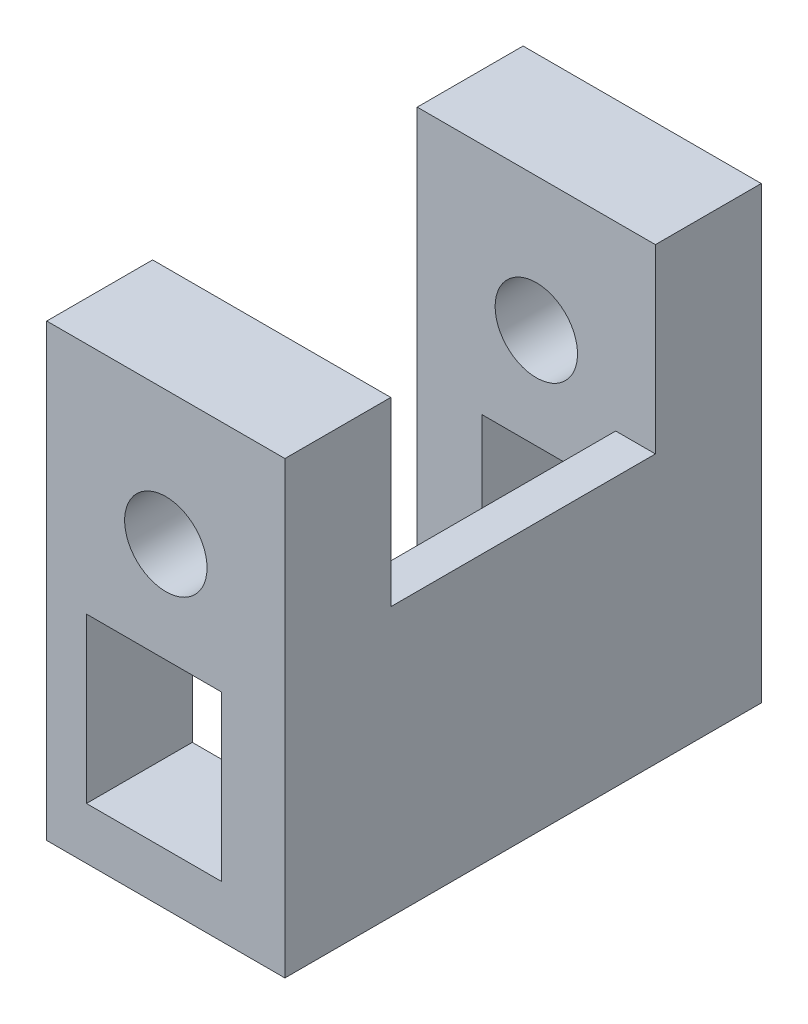
ISO-10303-21;
HEADER;
FILE_DESCRIPTION(('STEP AP214'),'2;1');
FILE_NAME('part.step','',(''),(''),'','','');
FILE_SCHEMA(('AUTOMOTIVE_DESIGN { 1 0 10303 214 1 1 1 1 }'));
ENDSEC;
DATA;
#1=APPLICATION_CONTEXT('core data for automotive mechanical design processes');
#2=APPLICATION_PROTOCOL_DEFINITION('international standard','automotive_design',2000,#1);
#3=PRODUCT_CONTEXT('',#1,'mechanical');
#4=PRODUCT('Part','Part','',(#3));
#5=PRODUCT_RELATED_PRODUCT_CATEGORY('part','',(#4));
#6=PRODUCT_DEFINITION_FORMATION('','',#4);
#7=PRODUCT_DEFINITION_CONTEXT('part definition',#1,'design');
#8=PRODUCT_DEFINITION('design','',#6,#7);
#9=PRODUCT_DEFINITION_SHAPE('','',#8);
#10=(LENGTH_UNIT() NAMED_UNIT(*) SI_UNIT(.MILLI.,.METRE.));
#11=(NAMED_UNIT(*) PLANE_ANGLE_UNIT() SI_UNIT($,.RADIAN.));
#12=(NAMED_UNIT(*) SI_UNIT($,.STERADIAN.) SOLID_ANGLE_UNIT());
#13=UNCERTAINTY_MEASURE_WITH_UNIT(LENGTH_MEASURE(1.E-05),#10,'distance_accuracy_value','');
#14=(GEOMETRIC_REPRESENTATION_CONTEXT(3) GLOBAL_UNCERTAINTY_ASSIGNED_CONTEXT((#13)) GLOBAL_UNIT_ASSIGNED_CONTEXT((#10,
#11,#12)) REPRESENTATION_CONTEXT('',''));
#15=CARTESIAN_POINT('',(0.,0.,0.));
#16=DIRECTION('',(0.,0.,1.));
#17=DIRECTION('',(1.,0.,0.));
#18=AXIS2_PLACEMENT_3D('',#15,#16,#17);
#19=CARTESIAN_POINT('',(0.,0.,-26.0613622377747));
#20=DIRECTION('',(0.,0.,1.));
#21=DIRECTION('',(1.,0.,0.));
#22=AXIS2_PLACEMENT_3D('',#19,#20,#21);
#23=PLANE('',#22);
#24=CARTESIAN_POINT('',(9.60609676616355,3.22413778328675,-26.0613622377747));
#25=DIRECTION('',(0.,0.,-1.));
#26=DIRECTION('',(-1.,0.,0.));
#27=AXIS2_PLACEMENT_3D('',#24,#25,#26);
#28=CIRCLE('',#27,1.55688018002512);
#29=CARTESIAN_POINT('',(8.04921658613843,3.22413778328675,-26.0613622377747));
#30=VERTEX_POINT('',#29);
#31=EDGE_CURVE('E238',#30,#30,#28,.T.);
#32=ORIENTED_EDGE('',*,*,#31,.F.);
#33=EDGE_LOOP('',(#32));
#34=FACE_BOUND('',#33,.T.);
#35=DIRECTION('',(0.,-1.,0.));
#36=VECTOR('',#35,1.);
#37=CARTESIAN_POINT('',(14.1060967661635,-8.72562551625901,-26.0613622377747));
#38=LINE('',#37,#36);
#39=CARTESIAN_POINT('',(14.1060967661635,8.27437448373586,-26.0613622377747));
#40=VERTEX_POINT('',#39);
#41=CARTESIAN_POINT('',(14.1060967661635,-8.72562551625901,-26.0613622377747));
#42=VERTEX_POINT('',#41);
#43=EDGE_CURVE('E291',#40,#42,#38,.T.);
#44=ORIENTED_EDGE('',*,*,#43,.T.);
#45=DIRECTION('',(-1.,0.,0.));
#46=VECTOR('',#45,1.);
#47=CARTESIAN_POINT('',(5.10609676616354,-8.72562551625901,-26.0613622377747));
#48=LINE('',#47,#46);
#49=CARTESIAN_POINT('',(5.10609676616354,-8.72562551625901,-26.0613622377747));
#50=VERTEX_POINT('',#49);
#51=EDGE_CURVE('E289',#42,#50,#48,.T.);
#52=ORIENTED_EDGE('',*,*,#51,.T.);
#53=DIRECTION('',(0.,1.,0.));
#54=VECTOR('',#53,1.);
#55=CARTESIAN_POINT('',(5.10609676616354,1.42461118419149,-26.0613622377747));
#56=LINE('',#55,#54);
#57=CARTESIAN_POINT('',(5.10609676616355,8.27437448373586,-26.0613622377747));
#58=VERTEX_POINT('',#57);
#59=EDGE_CURVE('E275',#50,#58,#56,.T.);
#60=ORIENTED_EDGE('',*,*,#59,.T.);
#61=DIRECTION('',(1.,0.,0.));
#62=VECTOR('',#61,1.);
#63=CARTESIAN_POINT('',(5.10609676616355,8.27437448373586,-26.0613622377747));
#64=LINE('',#63,#62);
#65=EDGE_CURVE('E242',#58,#40,#64,.T.);
#66=ORIENTED_EDGE('',*,*,#65,.T.);
#67=EDGE_LOOP('',(#44,#52,#60,#66));
#68=FACE_BOUND('',#67,.T.);
#69=DIRECTION('',(0.,1.,0.));
#70=VECTOR('',#69,1.);
#71=CARTESIAN_POINT('',(7.55555790180473,-6.76438338319341,-26.0613622377747));
#72=LINE('',#71,#70);
#73=CARTESIAN_POINT('',(7.55555790180473,-6.76438338319341,-26.0613622377747));
#74=VERTEX_POINT('',#73);
#75=CARTESIAN_POINT('',(7.55555790180473,-0.564383383193409,-26.0613622377747));
#76=VERTEX_POINT('',#75);
#77=EDGE_CURVE('E258',#74,#76,#72,.T.);
#78=ORIENTED_EDGE('',*,*,#77,.F.);
#79=DIRECTION('',(-1.,0.,0.));
#80=VECTOR('',#79,1.);
#81=CARTESIAN_POINT('',(10.7555579018047,-6.76438338319341,-26.0613622377747));
#82=LINE('',#81,#80);
#83=CARTESIAN_POINT('',(10.7555579018047,-6.76438338319341,-26.0613622377747));
#84=VERTEX_POINT('',#83);
#85=EDGE_CURVE('E302',#84,#74,#82,.T.);
#86=ORIENTED_EDGE('',*,*,#85,.F.);
#87=DIRECTION('',(0.,-1.,0.));
#88=VECTOR('',#87,1.);
#89=CARTESIAN_POINT('',(10.7555579018047,-0.564383383193409,-26.0613622377747));
#90=LINE('',#89,#88);
#91=CARTESIAN_POINT('',(10.7555579018047,-0.564383383193409,-26.0613622377747));
#92=VERTEX_POINT('',#91);
#93=EDGE_CURVE('E316',#92,#84,#90,.T.);
#94=ORIENTED_EDGE('',*,*,#93,.F.);
#95=DIRECTION('',(1.,0.,0.));
#96=VECTOR('',#95,1.);
#97=CARTESIAN_POINT('',(7.55555790180473,-0.564383383193409,-26.0613622377747));
#98=LINE('',#97,#96);
#99=EDGE_CURVE('E317',#76,#92,#98,.T.);
#100=ORIENTED_EDGE('',*,*,#99,.F.);
#101=EDGE_LOOP('',(#78,#86,#94,#100));
#102=FACE_BOUND('',#101,.T.);
#103=ADVANCED_FACE('F32',(#34,#68,#102),#23,.F.);
#104=CARTESIAN_POINT('',(0.,0.,-22.0613622377747));
#105=DIRECTION('',(0.,0.,1.));
#106=DIRECTION('',(1.,0.,0.));
#107=AXIS2_PLACEMENT_3D('',#104,#105,#106);
#108=PLANE('',#107);
#109=CARTESIAN_POINT('',(9.60609676616355,3.22413778328675,-22.0613622377747));
#110=DIRECTION('',(0.,0.,-1.));
#111=DIRECTION('',(-1.,0.,0.));
#112=AXIS2_PLACEMENT_3D('',#109,#110,#111);
#113=CIRCLE('',#112,1.55688018002512);
#114=CARTESIAN_POINT('',(8.04921658613843,3.22413778328675,-22.0613622377747));
#115=VERTEX_POINT('',#114);
#116=EDGE_CURVE('E234',#115,#115,#113,.T.);
#117=ORIENTED_EDGE('',*,*,#116,.T.);
#118=EDGE_LOOP('',(#117));
#119=FACE_BOUND('',#118,.T.);
#120=DIRECTION('',(7.80039844240735E-05,-0.999999996957689,0.));
#121=VECTOR('',#120,1.);
#122=CARTESIAN_POINT('',(12.6060967661635,-8.72562551625901,-22.0613622377747));
#123=LINE('',#122,#121);
#124=CARTESIAN_POINT('',(12.6053050072557,1.42461118419149,-22.0613622377747));
#125=VERTEX_POINT('',#124);
#126=CARTESIAN_POINT('',(12.6060967661635,-8.72562551625901,-22.0613622377747));
#127=VERTEX_POINT('',#126);
#128=EDGE_CURVE('E261',#125,#127,#123,.T.);
#129=ORIENTED_EDGE('',*,*,#128,.F.);
#130=DIRECTION('',(-1.,0.,0.));
#131=VECTOR('',#130,1.);
#132=CARTESIAN_POINT('',(14.1060967661635,1.42461118419149,-22.0613622377747));
#133=LINE('',#132,#131);
#134=CARTESIAN_POINT('',(14.1060967661635,1.42461118419149,-22.0613622377747));
#135=VERTEX_POINT('',#134);
#136=EDGE_CURVE('E251',#135,#125,#133,.T.);
#137=ORIENTED_EDGE('',*,*,#136,.F.);
#138=DIRECTION('',(0.,-1.,0.));
#139=VECTOR('',#138,1.);
#140=CARTESIAN_POINT('',(14.1060967661635,8.27437448373586,-22.0613622377747));
#141=LINE('',#140,#139);
#142=CARTESIAN_POINT('',(14.1060967661635,8.27437448373586,-22.0613622377747));
#143=VERTEX_POINT('',#142);
#144=EDGE_CURVE('E237',#143,#135,#141,.T.);
#145=ORIENTED_EDGE('',*,*,#144,.F.);
#146=DIRECTION('',(1.,0.,0.));
#147=VECTOR('',#146,1.);
#148=CARTESIAN_POINT('',(5.10609676616355,8.27437448373586,-22.0613622377747));
#149=LINE('',#148,#147);
#150=CARTESIAN_POINT('',(5.10609676616355,8.27437448373586,-22.0613622377747));
#151=VERTEX_POINT('',#150);
#152=EDGE_CURVE('E246',#151,#143,#149,.T.);
#153=ORIENTED_EDGE('',*,*,#152,.F.);
#154=DIRECTION('',(0.,1.,0.));
#155=VECTOR('',#154,1.);
#156=CARTESIAN_POINT('',(5.10609676616354,1.42461118419149,-22.0613622377747));
#157=LINE('',#156,#155);
#158=CARTESIAN_POINT('',(5.10609676616354,-8.72562551625901,-22.0613622377747));
#159=VERTEX_POINT('',#158);
#160=EDGE_CURVE('E280',#159,#151,#157,.T.);
#161=ORIENTED_EDGE('',*,*,#160,.F.);
#162=DIRECTION('',(-1.,0.,0.));
#163=VECTOR('',#162,1.);
#164=CARTESIAN_POINT('',(5.10609676616354,-8.72562551625901,-22.0613622377747));
#165=LINE('',#164,#163);
#166=EDGE_CURVE('E284',#127,#159,#165,.T.);
#167=ORIENTED_EDGE('',*,*,#166,.F.);
#168=EDGE_LOOP('',(#129,#137,#145,#153,#161,#167));
#169=FACE_BOUND('',#168,.T.);
#170=DIRECTION('',(-1.,0.,0.));
#171=VECTOR('',#170,1.);
#172=CARTESIAN_POINT('',(10.7555579018047,-6.76438338319341,-22.0613622377747));
#173=LINE('',#172,#171);
#174=CARTESIAN_POINT('',(10.7555579018047,-6.76438338319341,-22.0613622377747));
#175=VERTEX_POINT('',#174);
#176=CARTESIAN_POINT('',(7.55555790180473,-6.76438338319341,-22.0613622377747));
#177=VERTEX_POINT('',#176);
#178=EDGE_CURVE('E303',#175,#177,#173,.T.);
#179=ORIENTED_EDGE('',*,*,#178,.T.);
#180=DIRECTION('',(0.,1.,0.));
#181=VECTOR('',#180,1.);
#182=CARTESIAN_POINT('',(7.55555790180473,-6.76438338319341,-22.0613622377747));
#183=LINE('',#182,#181);
#184=CARTESIAN_POINT('',(7.55555790180473,-0.564383383193409,-22.0613622377747));
#185=VERTEX_POINT('',#184);
#186=EDGE_CURVE('E312',#177,#185,#183,.T.);
#187=ORIENTED_EDGE('',*,*,#186,.T.);
#188=DIRECTION('',(1.,0.,0.));
#189=VECTOR('',#188,1.);
#190=CARTESIAN_POINT('',(7.55555790180473,-0.564383383193409,-22.0613622377747));
#191=LINE('',#190,#189);
#192=CARTESIAN_POINT('',(10.7555579018047,-0.564383383193409,-22.0613622377747));
#193=VERTEX_POINT('',#192);
#194=EDGE_CURVE('E309',#185,#193,#191,.T.);
#195=ORIENTED_EDGE('',*,*,#194,.T.);
#196=DIRECTION('',(0.,-1.,0.));
#197=VECTOR('',#196,1.);
#198=CARTESIAN_POINT('',(10.7555579018047,-0.564383383193409,-22.0613622377747));
#199=LINE('',#198,#197);
#200=EDGE_CURVE('E306',#193,#175,#199,.T.);
#201=ORIENTED_EDGE('',*,*,#200,.T.);
#202=EDGE_LOOP('',(#179,#187,#195,#201));
#203=FACE_BOUND('',#202,.T.);
#204=ADVANCED_FACE('F334',(#119,#169,#203),#108,.T.);
#205=CARTESIAN_POINT('',(14.1060967661635,-8.72562551625901,-26.0613622377747));
#206=DIRECTION('',(-1.,0.,0.));
#207=DIRECTION('',(0.,0.,1.));
#208=AXIS2_PLACEMENT_3D('',#205,#206,#207);
#209=PLANE('',#208);
#210=ORIENTED_EDGE('',*,*,#43,.F.);
#211=DIRECTION('',(0.,0.,1.));
#212=VECTOR('',#211,1.);
#213=CARTESIAN_POINT('',(14.1060967661635,8.27437448373586,-26.0613622377747));
#214=LINE('',#213,#212);
#215=EDGE_CURVE('E245',#40,#143,#214,.T.);
#216=ORIENTED_EDGE('',*,*,#215,.T.);
#217=ORIENTED_EDGE('',*,*,#144,.T.);
#218=DIRECTION('',(0.,0.,1.));
#219=VECTOR('',#218,1.);
#220=CARTESIAN_POINT('',(14.1060967661635,1.42461118419149,-26.0613622377747));
#221=LINE('',#220,#219);
#222=CARTESIAN_POINT('',(14.1060967661635,1.42461118419149,-12.0613622377747));
#223=VERTEX_POINT('',#222);
#224=EDGE_CURVE('E50',#135,#223,#221,.T.);
#225=ORIENTED_EDGE('',*,*,#224,.T.);
#226=DIRECTION('',(0.,1.,0.));
#227=VECTOR('',#226,1.);
#228=CARTESIAN_POINT('',(14.1060967661635,8.27437448373586,-12.0613622377747));
#229=LINE('',#228,#227);
#230=CARTESIAN_POINT('',(14.1060967661635,8.27437448373586,-12.0613622377747));
#231=VERTEX_POINT('',#230);
#232=EDGE_CURVE('E232',#223,#231,#229,.T.);
#233=ORIENTED_EDGE('',*,*,#232,.T.);
#234=DIRECTION('',(0.,0.,-1.));
#235=VECTOR('',#234,1.);
#236=CARTESIAN_POINT('',(14.1060967661635,8.27437448373586,-8.06136223777473));
#237=LINE('',#236,#235);
#238=CARTESIAN_POINT('',(14.1060967661635,8.27437448373586,-8.06136223777473));
#239=VERTEX_POINT('',#238);
#240=EDGE_CURVE('E382',#239,#231,#237,.T.);
#241=ORIENTED_EDGE('',*,*,#240,.F.);
#242=DIRECTION('',(0.,1.,0.));
#243=VECTOR('',#242,1.);
#244=CARTESIAN_POINT('',(14.1060967661635,8.27437448373586,-8.06136223777473));
#245=LINE('',#244,#243);
#246=CARTESIAN_POINT('',(14.1060967661635,-8.72562551625901,-8.06136223777473));
#247=VERTEX_POINT('',#246);
#248=EDGE_CURVE('E216',#247,#239,#245,.T.);
#249=ORIENTED_EDGE('',*,*,#248,.F.);
#250=DIRECTION('',(0.,0.,1.));
#251=VECTOR('',#250,1.);
#252=CARTESIAN_POINT('',(14.1060967661635,-8.72562551625901,-26.0613622377747));
#253=LINE('',#252,#251);
#254=EDGE_CURVE('E11',#42,#247,#253,.T.);
#255=ORIENTED_EDGE('',*,*,#254,.F.);
#256=EDGE_LOOP('',(#210,#216,#217,#225,#233,#241,#249,#255));
#257=FACE_BOUND('',#256,.T.);
#258=ADVANCED_FACE('F34',(#257),#209,.F.);
#259=CARTESIAN_POINT('',(5.10609676616354,-8.72562551625901,-26.0613622377747));
#260=DIRECTION('',(0.,1.,0.));
#261=DIRECTION('',(0.,0.,1.));
#262=AXIS2_PLACEMENT_3D('',#259,#260,#261);
#263=PLANE('',#262);
#264=ORIENTED_EDGE('',*,*,#254,.T.);
#265=DIRECTION('',(1.,0.,0.));
#266=VECTOR('',#265,1.);
#267=CARTESIAN_POINT('',(14.1060967661635,-8.72562551625901,-8.06136223777473));
#268=LINE('',#267,#266);
#269=CARTESIAN_POINT('',(5.10609676616353,-8.72562551625901,-8.06136223777473));
#270=VERTEX_POINT('',#269);
#271=EDGE_CURVE('E212',#270,#247,#268,.T.);
#272=ORIENTED_EDGE('',*,*,#271,.F.);
#273=DIRECTION('',(0.,0.,-1.));
#274=VECTOR('',#273,1.);
#275=CARTESIAN_POINT('',(5.10609676616353,-8.72562551625901,-8.06136223777473));
#276=LINE('',#275,#274);
#277=CARTESIAN_POINT('',(5.10609676616353,-8.72562551625901,-12.0613622377747));
#278=VERTEX_POINT('',#277);
#279=EDGE_CURVE('E241',#270,#278,#276,.T.);
#280=ORIENTED_EDGE('',*,*,#279,.T.);
#281=DIRECTION('',(1.,0.,0.));
#282=VECTOR('',#281,1.);
#283=CARTESIAN_POINT('',(14.1060967661635,-8.72562551625901,-12.0613622377747));
#284=LINE('',#283,#282);
#285=CARTESIAN_POINT('',(12.6060967661635,-8.72562551625901,-12.0613622377747));
#286=VERTEX_POINT('',#285);
#287=EDGE_CURVE('E223',#278,#286,#284,.T.);
#288=ORIENTED_EDGE('',*,*,#287,.T.);
#289=DIRECTION('',(0.,0.,-1.));
#290=VECTOR('',#289,1.);
#291=CARTESIAN_POINT('',(12.6060967661635,-8.72562551625901,-12.0613622377747));
#292=LINE('',#291,#290);
#293=EDGE_CURVE('E269',#286,#127,#292,.T.);
#294=ORIENTED_EDGE('',*,*,#293,.T.);
#295=ORIENTED_EDGE('',*,*,#166,.T.);
#296=DIRECTION('',(0.,0.,1.));
#297=VECTOR('',#296,1.);
#298=CARTESIAN_POINT('',(5.10609676616354,-8.72562551625901,-26.0613622377747));
#299=LINE('',#298,#297);
#300=EDGE_CURVE('E42',#50,#159,#299,.T.);
#301=ORIENTED_EDGE('',*,*,#300,.F.);
#302=ORIENTED_EDGE('',*,*,#51,.F.);
#303=EDGE_LOOP('',(#264,#272,#280,#288,#294,#295,#301,#302));
#304=FACE_BOUND('',#303,.T.);
#305=ADVANCED_FACE('F365',(#304),#263,.F.);
#306=CARTESIAN_POINT('',(5.10609676616354,1.42461118419149,-26.0613622377747));
#307=DIRECTION('',(1.,0.,0.));
#308=DIRECTION('',(0.,1.,0.));
#309=AXIS2_PLACEMENT_3D('',#306,#307,#308);
#310=PLANE('',#309);
#311=ORIENTED_EDGE('',*,*,#160,.T.);
#312=DIRECTION('',(0.,0.,1.));
#313=VECTOR('',#312,1.);
#314=CARTESIAN_POINT('',(5.10609676616355,8.27437448373586,-26.0613622377747));
#315=LINE('',#314,#313);
#316=EDGE_CURVE('E253',#58,#151,#315,.T.);
#317=ORIENTED_EDGE('',*,*,#316,.F.);
#318=ORIENTED_EDGE('',*,*,#59,.F.);
#319=ORIENTED_EDGE('',*,*,#300,.T.);
#320=EDGE_LOOP('',(#311,#317,#318,#319));
#321=FACE_BOUND('',#320,.T.);
#322=ADVANCED_FACE('F363',(#321),#310,.F.);
#323=CARTESIAN_POINT('',(14.1060967661635,1.42461118419149,-26.0613622377747));
#324=DIRECTION('',(0.,-1.,0.));
#325=DIRECTION('',(0.,0.,-1.));
#326=AXIS2_PLACEMENT_3D('',#323,#324,#325);
#327=PLANE('',#326);
#328=ORIENTED_EDGE('',*,*,#224,.F.);
#329=ORIENTED_EDGE('',*,*,#136,.T.);
#330=DIRECTION('',(0.,0.,-1.));
#331=VECTOR('',#330,1.);
#332=CARTESIAN_POINT('',(12.6053050072557,1.42461118419149,-12.0613622377747));
#333=LINE('',#332,#331);
#334=CARTESIAN_POINT('',(12.6053050072557,1.42461118419149,-12.0613622377747));
#335=VERTEX_POINT('',#334);
#336=EDGE_CURVE('E267',#335,#125,#333,.T.);
#337=ORIENTED_EDGE('',*,*,#336,.F.);
#338=DIRECTION('',(-1.,0.,0.));
#339=VECTOR('',#338,1.);
#340=CARTESIAN_POINT('',(12.6053050072557,1.42461118419149,-12.0613622377747));
#341=LINE('',#340,#339);
#342=EDGE_CURVE('E270',#223,#335,#341,.T.);
#343=ORIENTED_EDGE('',*,*,#342,.F.);
#344=EDGE_LOOP('',(#328,#329,#337,#343));
#345=FACE_BOUND('',#344,.T.);
#346=ADVANCED_FACE('F360',(#345),#327,.F.);
#347=CARTESIAN_POINT('',(7.55555790180473,-6.76438338319341,-26.0613622377747));
#348=DIRECTION('',(1.,0.,0.));
#349=DIRECTION('',(0.,1.,0.));
#350=AXIS2_PLACEMENT_3D('',#347,#348,#349);
#351=PLANE('',#350);
#352=ORIENTED_EDGE('',*,*,#186,.F.);
#353=DIRECTION('',(0.,0.,1.));
#354=VECTOR('',#353,1.);
#355=CARTESIAN_POINT('',(7.55555790180473,-6.76438338319341,-26.0613622377747));
#356=LINE('',#355,#354);
#357=EDGE_CURVE('E299',#74,#177,#356,.T.);
#358=ORIENTED_EDGE('',*,*,#357,.F.);
#359=ORIENTED_EDGE('',*,*,#77,.T.);
#360=DIRECTION('',(0.,0.,1.));
#361=VECTOR('',#360,1.);
#362=CARTESIAN_POINT('',(7.55555790180473,-0.564383383193409,-26.0613622377747));
#363=LINE('',#362,#361);
#364=EDGE_CURVE('E285',#76,#185,#363,.T.);
#365=ORIENTED_EDGE('',*,*,#364,.T.);
#366=EDGE_LOOP('',(#352,#358,#359,#365));
#367=FACE_BOUND('',#366,.T.);
#368=ADVANCED_FACE('F325',(#367),#351,.T.);
#369=CARTESIAN_POINT('',(7.55555790180473,-0.564383383193409,-26.0613622377747));
#370=DIRECTION('',(0.,-1.,0.));
#371=DIRECTION('',(0.,0.,-1.));
#372=AXIS2_PLACEMENT_3D('',#369,#370,#371);
#373=PLANE('',#372);
#374=ORIENTED_EDGE('',*,*,#194,.F.);
#375=ORIENTED_EDGE('',*,*,#364,.F.);
#376=ORIENTED_EDGE('',*,*,#99,.T.);
#377=DIRECTION('',(0.,0.,1.));
#378=VECTOR('',#377,1.);
#379=CARTESIAN_POINT('',(10.7555579018047,-0.564383383193409,-26.0613622377747));
#380=LINE('',#379,#378);
#381=EDGE_CURVE('E296',#92,#193,#380,.T.);
#382=ORIENTED_EDGE('',*,*,#381,.T.);
#383=EDGE_LOOP('',(#374,#375,#376,#382));
#384=FACE_BOUND('',#383,.T.);
#385=ADVANCED_FACE('F328',(#384),#373,.T.);
#386=CARTESIAN_POINT('',(10.7555579018047,-0.564383383193409,-26.0613622377747));
#387=DIRECTION('',(-1.,0.,0.));
#388=DIRECTION('',(0.,0.,1.));
#389=AXIS2_PLACEMENT_3D('',#386,#387,#388);
#390=PLANE('',#389);
#391=ORIENTED_EDGE('',*,*,#200,.F.);
#392=ORIENTED_EDGE('',*,*,#381,.F.);
#393=ORIENTED_EDGE('',*,*,#93,.T.);
#394=DIRECTION('',(0.,0.,1.));
#395=VECTOR('',#394,1.);
#396=CARTESIAN_POINT('',(10.7555579018047,-6.76438338319341,-26.0613622377747));
#397=LINE('',#396,#395);
#398=EDGE_CURVE('E58',#84,#175,#397,.T.);
#399=ORIENTED_EDGE('',*,*,#398,.T.);
#400=EDGE_LOOP('',(#391,#392,#393,#399));
#401=FACE_BOUND('',#400,.T.);
#402=ADVANCED_FACE('F332',(#401),#390,.T.);
#403=CARTESIAN_POINT('',(10.7555579018047,-6.76438338319341,-26.0613622377747));
#404=DIRECTION('',(0.,1.,0.));
#405=DIRECTION('',(0.,0.,1.));
#406=AXIS2_PLACEMENT_3D('',#403,#404,#405);
#407=PLANE('',#406);
#408=ORIENTED_EDGE('',*,*,#178,.F.);
#409=ORIENTED_EDGE('',*,*,#398,.F.);
#410=ORIENTED_EDGE('',*,*,#85,.T.);
#411=ORIENTED_EDGE('',*,*,#357,.T.);
#412=EDGE_LOOP('',(#408,#409,#410,#411));
#413=FACE_BOUND('',#412,.T.);
#414=ADVANCED_FACE('F335',(#413),#407,.T.);
#415=CARTESIAN_POINT('',(12.6060967661635,-8.72562551625901,-12.0613622377747));
#416=DIRECTION('',(0.999999996957689,7.80039844240735E-05,0.));
#417=DIRECTION('',(-7.80039844240735E-05,0.999999996957689,0.));
#418=AXIS2_PLACEMENT_3D('',#415,#416,#417);
#419=PLANE('',#418);
#420=ORIENTED_EDGE('',*,*,#128,.T.);
#421=ORIENTED_EDGE('',*,*,#293,.F.);
#422=DIRECTION('',(7.80039844240735E-05,-0.999999996957689,0.));
#423=VECTOR('',#422,1.);
#424=CARTESIAN_POINT('',(12.6060967661635,-8.72562551625901,-12.0613622377747));
#425=LINE('',#424,#423);
#426=EDGE_CURVE('E36',#335,#286,#425,.T.);
#427=ORIENTED_EDGE('',*,*,#426,.F.);
#428=ORIENTED_EDGE('',*,*,#336,.T.);
#429=EDGE_LOOP('',(#420,#421,#427,#428));
#430=FACE_BOUND('',#429,.T.);
#431=ADVANCED_FACE('F337',(#430),#419,.F.);
#432=CARTESIAN_POINT('',(5.10609676616355,8.27437448373586,-26.0613622377747));
#433=DIRECTION('',(0.,-1.,0.));
#434=DIRECTION('',(0.,0.,-1.));
#435=AXIS2_PLACEMENT_3D('',#432,#433,#434);
#436=PLANE('',#435);
#437=ORIENTED_EDGE('',*,*,#152,.T.);
#438=ORIENTED_EDGE('',*,*,#215,.F.);
#439=ORIENTED_EDGE('',*,*,#65,.F.);
#440=ORIENTED_EDGE('',*,*,#316,.T.);
#441=EDGE_LOOP('',(#437,#438,#439,#440));
#442=FACE_BOUND('',#441,.T.);
#443=ADVANCED_FACE('F343',(#442),#436,.F.);
#444=CARTESIAN_POINT('',(9.60609676616355,3.22413778328675,-22.0613622377747));
#445=DIRECTION('',(0.,0.,-1.));
#446=DIRECTION('',(-1.,0.,0.));
#447=AXIS2_PLACEMENT_3D('',#444,#445,#446);
#448=CYLINDRICAL_SURFACE('',#447,1.55688018002512);
#449=ORIENTED_EDGE('',*,*,#116,.F.);
#450=EDGE_LOOP('',(#449));
#451=FACE_BOUND('',#450,.T.);
#452=ORIENTED_EDGE('',*,*,#31,.T.);
#453=EDGE_LOOP('',(#452));
#454=FACE_BOUND('',#453,.T.);
#455=ADVANCED_FACE('F419',(#451,#454),#448,.F.);
#456=CARTESIAN_POINT('',(0.,0.,-8.06136223777473));
#457=DIRECTION('',(0.,0.,-1.));
#458=DIRECTION('',(-1.,0.,0.));
#459=AXIS2_PLACEMENT_3D('',#456,#457,#458);
#460=PLANE('',#459);
#461=CARTESIAN_POINT('',(9.60609676616355,3.22413778328675,-8.06136223777473));
#462=DIRECTION('',(0.,0.,1.));
#463=DIRECTION('',(1.,0.,0.));
#464=AXIS2_PLACEMENT_3D('',#461,#462,#463);
#465=CIRCLE('',#464,1.55688018002512);
#466=CARTESIAN_POINT('',(11.1629769461887,3.22413778328675,-8.06136223777473));
#467=VERTEX_POINT('',#466);
#468=EDGE_CURVE('E203',#467,#467,#465,.T.);
#469=ORIENTED_EDGE('',*,*,#468,.F.);
#470=EDGE_LOOP('',(#469));
#471=FACE_BOUND('',#470,.T.);
#472=DIRECTION('',(0.,-1.,0.));
#473=VECTOR('',#472,1.);
#474=CARTESIAN_POINT('',(5.10609676616353,-8.72562551625901,-8.06136223777473));
#475=LINE('',#474,#473);
#476=CARTESIAN_POINT('',(5.10609676616355,8.27437448373586,-8.06136223777473));
#477=VERTEX_POINT('',#476);
#478=EDGE_CURVE('E209',#477,#270,#475,.T.);
#479=ORIENTED_EDGE('',*,*,#478,.T.);
#480=ORIENTED_EDGE('',*,*,#271,.T.);
#481=ORIENTED_EDGE('',*,*,#248,.T.);
#482=DIRECTION('',(-1.,0.,0.));
#483=VECTOR('',#482,1.);
#484=CARTESIAN_POINT('',(5.10609676616355,8.27437448373586,-8.06136223777473));
#485=LINE('',#484,#483);
#486=EDGE_CURVE('E218',#239,#477,#485,.T.);
#487=ORIENTED_EDGE('',*,*,#486,.T.);
#488=EDGE_LOOP('',(#479,#480,#481,#487));
#489=FACE_BOUND('',#488,.T.);
#490=DIRECTION('',(0.,-1.,0.));
#491=VECTOR('',#490,1.);
#492=CARTESIAN_POINT('',(6.60609676616355,-6.76438338319285,-8.06136223777473));
#493=LINE('',#492,#491);
#494=CARTESIAN_POINT('',(6.60609676616355,-0.564383383192854,-8.06136223777473));
#495=VERTEX_POINT('',#494);
#496=CARTESIAN_POINT('',(6.60609676616355,-6.76438338319285,-8.06136223777473));
#497=VERTEX_POINT('',#496);
#498=EDGE_CURVE('E161',#495,#497,#493,.T.);
#499=ORIENTED_EDGE('',*,*,#498,.F.);
#500=DIRECTION('',(-1.,1.08868400571435E-13,0.));
#501=VECTOR('',#500,1.);
#502=CARTESIAN_POINT('',(6.60609676616355,-0.564383383192854,-8.06136223777473));
#503=LINE('',#502,#501);
#504=CARTESIAN_POINT('',(11.7050190374459,-0.564383383193409,-8.06136223777473));
#505=VERTEX_POINT('',#504);
#506=EDGE_CURVE('E187',#505,#495,#503,.T.);
#507=ORIENTED_EDGE('',*,*,#506,.F.);
#508=DIRECTION('',(0.,1.,0.));
#509=VECTOR('',#508,1.);
#510=CARTESIAN_POINT('',(11.7050190374459,-0.564383383193409,-8.06136223777473));
#511=LINE('',#510,#509);
#512=CARTESIAN_POINT('',(11.7050190374459,-6.76438338319341,-8.06136223777473));
#513=VERTEX_POINT('',#512);
#514=EDGE_CURVE('E185',#513,#505,#511,.T.);
#515=ORIENTED_EDGE('',*,*,#514,.F.);
#516=DIRECTION('',(1.,-1.08187973067863E-13,0.));
#517=VECTOR('',#516,1.);
#518=CARTESIAN_POINT('',(11.7050190374459,-6.76438338319341,-8.06136223777473));
#519=LINE('',#518,#517);
#520=EDGE_CURVE('E171',#497,#513,#519,.T.);
#521=ORIENTED_EDGE('',*,*,#520,.F.);
#522=EDGE_LOOP('',(#499,#507,#515,#521));
#523=FACE_BOUND('',#522,.T.);
#524=ADVANCED_FACE('F183',(#471,#489,#523),#460,.F.);
#525=CARTESIAN_POINT('',(0.,0.,-12.0613622377747));
#526=DIRECTION('',(0.,0.,-1.));
#527=DIRECTION('',(-1.,0.,0.));
#528=AXIS2_PLACEMENT_3D('',#525,#526,#527);
#529=PLANE('',#528);
#530=CARTESIAN_POINT('',(9.60609676616355,3.22413778328675,-12.0613622377747));
#531=DIRECTION('',(0.,0.,1.));
#532=DIRECTION('',(1.,0.,0.));
#533=AXIS2_PLACEMENT_3D('',#530,#531,#532);
#534=CIRCLE('',#533,1.55688018002512);
#535=CARTESIAN_POINT('',(11.1629769461887,3.22413778328675,-12.0613622377747));
#536=VERTEX_POINT('',#535);
#537=EDGE_CURVE('E179',#536,#536,#534,.T.);
#538=ORIENTED_EDGE('',*,*,#537,.T.);
#539=EDGE_LOOP('',(#538));
#540=FACE_BOUND('',#539,.T.);
#541=ORIENTED_EDGE('',*,*,#342,.T.);
#542=ORIENTED_EDGE('',*,*,#426,.T.);
#543=ORIENTED_EDGE('',*,*,#287,.F.);
#544=DIRECTION('',(0.,-1.,0.));
#545=VECTOR('',#544,1.);
#546=CARTESIAN_POINT('',(5.10609676616353,-8.72562551625901,-12.0613622377747));
#547=LINE('',#546,#545);
#548=CARTESIAN_POINT('',(5.10609676616355,8.27437448373586,-12.0613622377747));
#549=VERTEX_POINT('',#548);
#550=EDGE_CURVE('E206',#549,#278,#547,.T.);
#551=ORIENTED_EDGE('',*,*,#550,.F.);
#552=DIRECTION('',(-1.,0.,0.));
#553=VECTOR('',#552,1.);
#554=CARTESIAN_POINT('',(5.10609676616355,8.27437448373586,-12.0613622377747));
#555=LINE('',#554,#553);
#556=EDGE_CURVE('E213',#231,#549,#555,.T.);
#557=ORIENTED_EDGE('',*,*,#556,.F.);
#558=ORIENTED_EDGE('',*,*,#232,.F.);
#559=EDGE_LOOP('',(#541,#542,#543,#551,#557,#558));
#560=FACE_BOUND('',#559,.T.);
#561=DIRECTION('',(-1.,1.08868400571435E-13,0.));
#562=VECTOR('',#561,1.);
#563=CARTESIAN_POINT('',(6.60609676616355,-0.564383383192854,-12.0613622377747));
#564=LINE('',#563,#562);
#565=CARTESIAN_POINT('',(11.7050190374459,-0.564383383193409,-12.0613622377747));
#566=VERTEX_POINT('',#565);
#567=CARTESIAN_POINT('',(6.60609676616355,-0.564383383192854,-12.0613622377747));
#568=VERTEX_POINT('',#567);
#569=EDGE_CURVE('E172',#566,#568,#564,.T.);
#570=ORIENTED_EDGE('',*,*,#569,.T.);
#571=DIRECTION('',(0.,-1.,0.));
#572=VECTOR('',#571,1.);
#573=CARTESIAN_POINT('',(6.60609676616355,-6.76438338319285,-12.0613622377747));
#574=LINE('',#573,#572);
#575=CARTESIAN_POINT('',(6.60609676616355,-6.76438338319285,-12.0613622377747));
#576=VERTEX_POINT('',#575);
#577=EDGE_CURVE('E191',#568,#576,#574,.T.);
#578=ORIENTED_EDGE('',*,*,#577,.T.);
#579=DIRECTION('',(1.,-1.08187973067863E-13,0.));
#580=VECTOR('',#579,1.);
#581=CARTESIAN_POINT('',(11.7050190374459,-6.76438338319341,-12.0613622377747));
#582=LINE('',#581,#580);
#583=CARTESIAN_POINT('',(11.7050190374459,-6.76438338319341,-12.0613622377747));
#584=VERTEX_POINT('',#583);
#585=EDGE_CURVE('E178',#576,#584,#582,.T.);
#586=ORIENTED_EDGE('',*,*,#585,.T.);
#587=DIRECTION('',(0.,1.,0.));
#588=VECTOR('',#587,1.);
#589=CARTESIAN_POINT('',(11.7050190374459,-0.564383383193409,-12.0613622377747));
#590=LINE('',#589,#588);
#591=EDGE_CURVE('E194',#584,#566,#590,.T.);
#592=ORIENTED_EDGE('',*,*,#591,.T.);
#593=EDGE_LOOP('',(#570,#578,#586,#592));
#594=FACE_BOUND('',#593,.T.);
#595=ADVANCED_FACE('F399',(#540,#560,#594),#529,.T.);
#596=CARTESIAN_POINT('',(5.10609676616353,-8.72562551625901,-8.06136223777473));
#597=DIRECTION('',(1.,0.,0.));
#598=DIRECTION('',(0.,1.,0.));
#599=AXIS2_PLACEMENT_3D('',#596,#597,#598);
#600=PLANE('',#599);
#601=ORIENTED_EDGE('',*,*,#550,.T.);
#602=ORIENTED_EDGE('',*,*,#279,.F.);
#603=ORIENTED_EDGE('',*,*,#478,.F.);
#604=DIRECTION('',(0.,0.,-1.));
#605=VECTOR('',#604,1.);
#606=CARTESIAN_POINT('',(5.10609676616355,8.27437448373586,-8.06136223777473));
#607=LINE('',#606,#605);
#608=EDGE_CURVE('E220',#477,#549,#607,.T.);
#609=ORIENTED_EDGE('',*,*,#608,.T.);
#610=EDGE_LOOP('',(#601,#602,#603,#609));
#611=FACE_BOUND('',#610,.T.);
#612=ADVANCED_FACE('F394',(#611),#600,.F.);
#613=CARTESIAN_POINT('',(5.10609676616355,8.27437448373586,-8.06136223777473));
#614=DIRECTION('',(0.,-1.,0.));
#615=DIRECTION('',(0.,0.,-1.));
#616=AXIS2_PLACEMENT_3D('',#613,#614,#615);
#617=PLANE('',#616);
#618=ORIENTED_EDGE('',*,*,#556,.T.);
#619=ORIENTED_EDGE('',*,*,#608,.F.);
#620=ORIENTED_EDGE('',*,*,#486,.F.);
#621=ORIENTED_EDGE('',*,*,#240,.T.);
#622=EDGE_LOOP('',(#618,#619,#620,#621));
#623=FACE_BOUND('',#622,.T.);
#624=ADVANCED_FACE('F389',(#623),#617,.F.);
#625=CARTESIAN_POINT('',(9.60609676616355,3.22413778328675,-8.06136223777473));
#626=DIRECTION('',(0.,0.,-1.));
#627=DIRECTION('',(-1.,0.,0.));
#628=AXIS2_PLACEMENT_3D('',#625,#626,#627);
#629=CYLINDRICAL_SURFACE('',#628,1.55688018002512);
#630=ORIENTED_EDGE('',*,*,#468,.T.);
#631=EDGE_LOOP('',(#630));
#632=FACE_BOUND('',#631,.T.);
#633=ORIENTED_EDGE('',*,*,#537,.F.);
#634=EDGE_LOOP('',(#633));
#635=FACE_BOUND('',#634,.T.);
#636=ADVANCED_FACE('F431',(#632,#635),#629,.F.);
#637=CARTESIAN_POINT('',(6.60609676616355,-6.76438338319285,-8.06136223777473));
#638=DIRECTION('',(1.,0.,0.));
#639=DIRECTION('',(0.,0.,-1.));
#640=AXIS2_PLACEMENT_3D('',#637,#638,#639);
#641=PLANE('',#640);
#642=ORIENTED_EDGE('',*,*,#577,.F.);
#643=DIRECTION('',(0.,0.,-1.));
#644=VECTOR('',#643,1.);
#645=CARTESIAN_POINT('',(6.60609676616355,-0.564383383192854,-8.06136223777473));
#646=LINE('',#645,#644);
#647=EDGE_CURVE('E167',#495,#568,#646,.T.);
#648=ORIENTED_EDGE('',*,*,#647,.F.);
#649=ORIENTED_EDGE('',*,*,#498,.T.);
#650=DIRECTION('',(0.,0.,-1.));
#651=VECTOR('',#650,1.);
#652=CARTESIAN_POINT('',(6.60609676616355,-6.76438338319285,-8.06136223777473));
#653=LINE('',#652,#651);
#654=EDGE_CURVE('E164',#497,#576,#653,.T.);
#655=ORIENTED_EDGE('',*,*,#654,.T.);
#656=EDGE_LOOP('',(#642,#648,#649,#655));
#657=FACE_BOUND('',#656,.T.);
#658=ADVANCED_FACE('F163',(#657),#641,.T.);
#659=CARTESIAN_POINT('',(11.7050190374459,-6.76438338319341,-8.06136223777473));
#660=DIRECTION('',(1.08187973067863E-13,1.,0.));
#661=DIRECTION('',(-1.,1.08187973067863E-13,0.));
#662=AXIS2_PLACEMENT_3D('',#659,#660,#661);
#663=PLANE('',#662);
#664=ORIENTED_EDGE('',*,*,#585,.F.);
#665=ORIENTED_EDGE('',*,*,#654,.F.);
#666=ORIENTED_EDGE('',*,*,#520,.T.);
#667=DIRECTION('',(0.,0.,-1.));
#668=VECTOR('',#667,1.);
#669=CARTESIAN_POINT('',(11.7050190374459,-6.76438338319341,-8.06136223777473));
#670=LINE('',#669,#668);
#671=EDGE_CURVE('E180',#513,#584,#670,.T.);
#672=ORIENTED_EDGE('',*,*,#671,.T.);
#673=EDGE_LOOP('',(#664,#665,#666,#672));
#674=FACE_BOUND('',#673,.T.);
#675=ADVANCED_FACE('F175',(#674),#663,.T.);
#676=CARTESIAN_POINT('',(11.7050190374459,-0.564383383193409,-8.06136223777473));
#677=DIRECTION('',(-1.,0.,0.));
#678=DIRECTION('',(0.,0.,1.));
#679=AXIS2_PLACEMENT_3D('',#676,#677,#678);
#680=PLANE('',#679);
#681=ORIENTED_EDGE('',*,*,#591,.F.);
#682=ORIENTED_EDGE('',*,*,#671,.F.);
#683=ORIENTED_EDGE('',*,*,#514,.T.);
#684=DIRECTION('',(0.,0.,-1.));
#685=VECTOR('',#684,1.);
#686=CARTESIAN_POINT('',(11.7050190374459,-0.564383383193409,-8.06136223777473));
#687=LINE('',#686,#685);
#688=EDGE_CURVE('E200',#505,#566,#687,.T.);
#689=ORIENTED_EDGE('',*,*,#688,.T.);
#690=EDGE_LOOP('',(#681,#682,#683,#689));
#691=FACE_BOUND('',#690,.T.);
#692=ADVANCED_FACE('F445',(#691),#680,.T.);
#693=CARTESIAN_POINT('',(6.60609676616355,-0.564383383192854,-8.06136223777473));
#694=DIRECTION('',(-1.08868400571435E-13,-1.,0.));
#695=DIRECTION('',(1.,-1.08868400571435E-13,0.));
#696=AXIS2_PLACEMENT_3D('',#693,#694,#695);
#697=PLANE('',#696);
#698=ORIENTED_EDGE('',*,*,#569,.F.);
#699=ORIENTED_EDGE('',*,*,#688,.F.);
#700=ORIENTED_EDGE('',*,*,#506,.T.);
#701=ORIENTED_EDGE('',*,*,#647,.T.);
#702=EDGE_LOOP('',(#698,#699,#700,#701));
#703=FACE_BOUND('',#702,.T.);
#704=ADVANCED_FACE('F448',(#703),#697,.T.);
#705=CLOSED_SHELL('',(#103,#204,#258,#305,#322,#346,#368,#385,#402,#414,#431,#443,#455,#524,
#595,#612,#624,#636,#658,#675,#692,#704));
#706=MANIFOLD_SOLID_BREP('B2',#705);
#707=ADVANCED_BREP_SHAPE_REPRESENTATION('',(#18,#706),#14);
#708=SHAPE_DEFINITION_REPRESENTATION(#9,#707);
ENDSEC;
END-ISO-10303-21;
